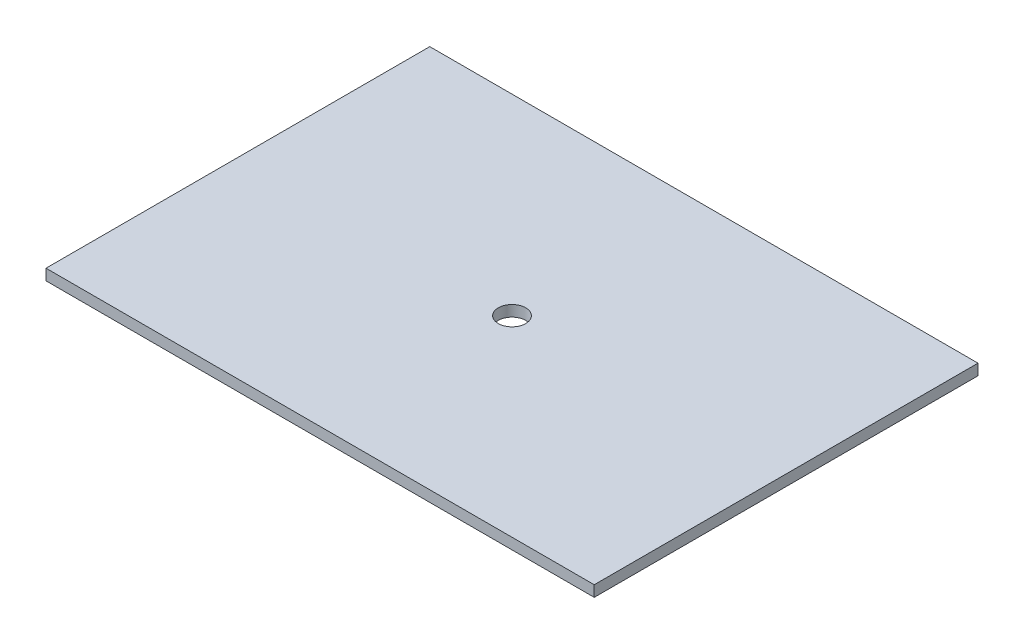
ISO-10303-21;
HEADER;
FILE_DESCRIPTION(('STEP AP214'),'2;1');
FILE_NAME('part.step','',(''),(''),'','','');
FILE_SCHEMA(('AUTOMOTIVE_DESIGN { 1 0 10303 214 1 1 1 1 }'));
ENDSEC;
DATA;
#1=APPLICATION_CONTEXT('core data for automotive mechanical design processes');
#2=APPLICATION_PROTOCOL_DEFINITION('international standard','automotive_design',2000,#1);
#3=PRODUCT_CONTEXT('',#1,'mechanical');
#4=PRODUCT('Part','Part','',(#3));
#5=PRODUCT_RELATED_PRODUCT_CATEGORY('part','',(#4));
#6=PRODUCT_DEFINITION_FORMATION('','',#4);
#7=PRODUCT_DEFINITION_CONTEXT('part definition',#1,'design');
#8=PRODUCT_DEFINITION('design','',#6,#7);
#9=PRODUCT_DEFINITION_SHAPE('','',#8);
#10=(LENGTH_UNIT() NAMED_UNIT(*) SI_UNIT(.MILLI.,.METRE.));
#11=(NAMED_UNIT(*) PLANE_ANGLE_UNIT() SI_UNIT($,.RADIAN.));
#12=(NAMED_UNIT(*) SI_UNIT($,.STERADIAN.) SOLID_ANGLE_UNIT());
#13=UNCERTAINTY_MEASURE_WITH_UNIT(LENGTH_MEASURE(1.E-05),#10,'distance_accuracy_value','');
#14=(GEOMETRIC_REPRESENTATION_CONTEXT(3) GLOBAL_UNCERTAINTY_ASSIGNED_CONTEXT((#13)) GLOBAL_UNIT_ASSIGNED_CONTEXT((#10,
#11,#12)) REPRESENTATION_CONTEXT('',''));
#15=CARTESIAN_POINT('',(0.,0.,0.));
#16=DIRECTION('',(0.,0.,1.));
#17=DIRECTION('',(1.,0.,0.));
#18=AXIS2_PLACEMENT_3D('',#15,#16,#17);
#19=CARTESIAN_POINT('',(0.,2.54,0.));
#20=DIRECTION('',(0.,1.,0.));
#21=DIRECTION('',(0.,0.,1.));
#22=AXIS2_PLACEMENT_3D('',#19,#20,#21);
#23=PLANE('',#22);
#24=DIRECTION('',(0.,0.,-1.));
#25=VECTOR('',#24,1.);
#26=CARTESIAN_POINT('',(0.,2.54,0.));
#27=LINE('',#26,#25);
#28=CARTESIAN_POINT('',(0.,2.54,0.));
#29=VERTEX_POINT('',#28);
#30=CARTESIAN_POINT('',(0.,2.54,-88.9));
#31=VERTEX_POINT('',#30);
#32=EDGE_CURVE('E86',#29,#31,#27,.T.);
#33=ORIENTED_EDGE('',*,*,#32,.T.);
#34=DIRECTION('',(-1.,0.,0.));
#35=VECTOR('',#34,1.);
#36=CARTESIAN_POINT('',(0.,2.54,-88.9));
#37=LINE('',#36,#35);
#38=CARTESIAN_POINT('',(-127.,2.54,-88.9));
#39=VERTEX_POINT('',#38);
#40=EDGE_CURVE('E81',#31,#39,#37,.T.);
#41=ORIENTED_EDGE('',*,*,#40,.T.);
#42=DIRECTION('',(0.,0.,1.));
#43=VECTOR('',#42,1.);
#44=CARTESIAN_POINT('',(-127.,2.54,0.));
#45=LINE('',#44,#43);
#46=CARTESIAN_POINT('',(-127.,2.54,0.));
#47=VERTEX_POINT('',#46);
#48=EDGE_CURVE('E84',#39,#47,#45,.T.);
#49=ORIENTED_EDGE('',*,*,#48,.T.);
#50=DIRECTION('',(1.,0.,0.));
#51=VECTOR('',#50,1.);
#52=CARTESIAN_POINT('',(0.,2.54,0.));
#53=LINE('',#52,#51);
#54=EDGE_CURVE('E51',#47,#29,#53,.T.);
#55=ORIENTED_EDGE('',*,*,#54,.T.);
#56=EDGE_LOOP('',(#33,#41,#49,#55));
#57=FACE_BOUND('',#56,.T.);
#58=CARTESIAN_POINT('',(-63.5,2.54,-44.45));
#59=DIRECTION('',(0.,1.,0.));
#60=DIRECTION('',(0.,0.,1.));
#61=AXIS2_PLACEMENT_3D('',#58,#59,#60);
#62=CIRCLE('',#61,3.175);
#63=CARTESIAN_POINT('',(-63.5,2.54,-41.275));
#64=VERTEX_POINT('',#63);
#65=EDGE_CURVE('E101',#64,#64,#62,.T.);
#66=ORIENTED_EDGE('',*,*,#65,.F.);
#67=EDGE_LOOP('',(#66));
#68=FACE_BOUND('',#67,.T.);
#69=ADVANCED_FACE('F34',(#57,#68),#23,.T.);
#70=CARTESIAN_POINT('',(0.,0.,0.));
#71=DIRECTION('',(0.,1.,0.));
#72=DIRECTION('',(0.,0.,1.));
#73=AXIS2_PLACEMENT_3D('',#70,#71,#72);
#74=PLANE('',#73);
#75=DIRECTION('',(0.,0.,-1.));
#76=VECTOR('',#75,1.);
#77=CARTESIAN_POINT('',(0.,0.,0.));
#78=LINE('',#77,#76);
#79=CARTESIAN_POINT('',(0.,0.,0.));
#80=VERTEX_POINT('',#79);
#81=CARTESIAN_POINT('',(0.,0.,-88.9));
#82=VERTEX_POINT('',#81);
#83=EDGE_CURVE('E98',#80,#82,#78,.T.);
#84=ORIENTED_EDGE('',*,*,#83,.F.);
#85=DIRECTION('',(1.,0.,0.));
#86=VECTOR('',#85,1.);
#87=CARTESIAN_POINT('',(0.,0.,0.));
#88=LINE('',#87,#86);
#89=CARTESIAN_POINT('',(-127.,0.,0.));
#90=VERTEX_POINT('',#89);
#91=EDGE_CURVE('E74',#90,#80,#88,.T.);
#92=ORIENTED_EDGE('',*,*,#91,.F.);
#93=DIRECTION('',(0.,0.,1.));
#94=VECTOR('',#93,1.);
#95=CARTESIAN_POINT('',(-127.,0.,0.));
#96=LINE('',#95,#94);
#97=CARTESIAN_POINT('',(-127.,0.,-88.9));
#98=VERTEX_POINT('',#97);
#99=EDGE_CURVE('E68',#98,#90,#96,.T.);
#100=ORIENTED_EDGE('',*,*,#99,.F.);
#101=DIRECTION('',(-1.,0.,0.));
#102=VECTOR('',#101,1.);
#103=CARTESIAN_POINT('',(0.,0.,-88.9));
#104=LINE('',#103,#102);
#105=EDGE_CURVE('E90',#82,#98,#104,.T.);
#106=ORIENTED_EDGE('',*,*,#105,.F.);
#107=EDGE_LOOP('',(#84,#92,#100,#106));
#108=FACE_BOUND('',#107,.T.);
#109=CARTESIAN_POINT('',(-63.5,0.,-44.45));
#110=DIRECTION('',(0.,1.,0.));
#111=DIRECTION('',(0.,0.,1.));
#112=AXIS2_PLACEMENT_3D('',#109,#110,#111);
#113=CIRCLE('',#112,3.175);
#114=CARTESIAN_POINT('',(-63.5,0.,-41.275));
#115=VERTEX_POINT('',#114);
#116=EDGE_CURVE('E113',#115,#115,#113,.T.);
#117=ORIENTED_EDGE('',*,*,#116,.T.);
#118=EDGE_LOOP('',(#117));
#119=FACE_BOUND('',#118,.T.);
#120=ADVANCED_FACE('F109',(#108,#119),#74,.F.);
#121=CARTESIAN_POINT('',(0.,2.54,0.));
#122=DIRECTION('',(-1.,0.,0.));
#123=DIRECTION('',(0.,0.,1.));
#124=AXIS2_PLACEMENT_3D('',#121,#122,#123);
#125=PLANE('',#124);
#126=ORIENTED_EDGE('',*,*,#83,.T.);
#127=DIRECTION('',(0.,-1.,0.));
#128=VECTOR('',#127,1.);
#129=CARTESIAN_POINT('',(0.,2.54,-88.9));
#130=LINE('',#129,#128);
#131=EDGE_CURVE('E11',#31,#82,#130,.T.);
#132=ORIENTED_EDGE('',*,*,#131,.F.);
#133=ORIENTED_EDGE('',*,*,#32,.F.);
#134=DIRECTION('',(0.,-1.,0.));
#135=VECTOR('',#134,1.);
#136=CARTESIAN_POINT('',(0.,2.54,0.));
#137=LINE('',#136,#135);
#138=EDGE_CURVE('E94',#29,#80,#137,.T.);
#139=ORIENTED_EDGE('',*,*,#138,.T.);
#140=EDGE_LOOP('',(#126,#132,#133,#139));
#141=FACE_BOUND('',#140,.T.);
#142=ADVANCED_FACE('F36',(#141),#125,.F.);
#143=CARTESIAN_POINT('',(0.,2.54,-88.9));
#144=DIRECTION('',(0.,0.,1.));
#145=DIRECTION('',(1.,0.,0.));
#146=AXIS2_PLACEMENT_3D('',#143,#144,#145);
#147=PLANE('',#146);
#148=ORIENTED_EDGE('',*,*,#105,.T.);
#149=DIRECTION('',(0.,-1.,0.));
#150=VECTOR('',#149,1.);
#151=CARTESIAN_POINT('',(-127.,2.54,-88.9));
#152=LINE('',#151,#150);
#153=EDGE_CURVE('E43',#39,#98,#152,.T.);
#154=ORIENTED_EDGE('',*,*,#153,.F.);
#155=ORIENTED_EDGE('',*,*,#40,.F.);
#156=ORIENTED_EDGE('',*,*,#131,.T.);
#157=EDGE_LOOP('',(#148,#154,#155,#156));
#158=FACE_BOUND('',#157,.T.);
#159=ADVANCED_FACE('F89',(#158),#147,.F.);
#160=CARTESIAN_POINT('',(-127.,2.54,0.));
#161=DIRECTION('',(1.,0.,0.));
#162=DIRECTION('',(0.,0.,-1.));
#163=AXIS2_PLACEMENT_3D('',#160,#161,#162);
#164=PLANE('',#163);
#165=ORIENTED_EDGE('',*,*,#99,.T.);
#166=DIRECTION('',(0.,-1.,0.));
#167=VECTOR('',#166,1.);
#168=CARTESIAN_POINT('',(-127.,2.54,0.));
#169=LINE('',#168,#167);
#170=EDGE_CURVE('E91',#47,#90,#169,.T.);
#171=ORIENTED_EDGE('',*,*,#170,.F.);
#172=ORIENTED_EDGE('',*,*,#48,.F.);
#173=ORIENTED_EDGE('',*,*,#153,.T.);
#174=EDGE_LOOP('',(#165,#171,#172,#173));
#175=FACE_BOUND('',#174,.T.);
#176=ADVANCED_FACE('F92',(#175),#164,.F.);
#177=CARTESIAN_POINT('',(0.,2.54,0.));
#178=DIRECTION('',(0.,0.,-1.));
#179=DIRECTION('',(-1.,0.,0.));
#180=AXIS2_PLACEMENT_3D('',#177,#178,#179);
#181=PLANE('',#180);
#182=ORIENTED_EDGE('',*,*,#91,.T.);
#183=ORIENTED_EDGE('',*,*,#138,.F.);
#184=ORIENTED_EDGE('',*,*,#54,.F.);
#185=ORIENTED_EDGE('',*,*,#170,.T.);
#186=EDGE_LOOP('',(#182,#183,#184,#185));
#187=FACE_BOUND('',#186,.T.);
#188=ADVANCED_FACE('F106',(#187),#181,.F.);
#189=CARTESIAN_POINT('',(-63.5,2.54,-44.45));
#190=DIRECTION('',(0.,-1.,0.));
#191=DIRECTION('',(0.,0.,-1.));
#192=AXIS2_PLACEMENT_3D('',#189,#190,#191);
#193=CYLINDRICAL_SURFACE('',#192,3.175);
#194=ORIENTED_EDGE('',*,*,#65,.T.);
#195=EDGE_LOOP('',(#194));
#196=FACE_BOUND('',#195,.T.);
#197=ORIENTED_EDGE('',*,*,#116,.F.);
#198=EDGE_LOOP('',(#197));
#199=FACE_BOUND('',#198,.T.);
#200=ADVANCED_FACE('F119',(#196,#199),#193,.F.);
#201=CLOSED_SHELL('',(#69,#120,#142,#159,#176,#188,#200));
#202=MANIFOLD_SOLID_BREP('B2',#201);
#203=ADVANCED_BREP_SHAPE_REPRESENTATION('',(#18,#202),#14);
#204=SHAPE_DEFINITION_REPRESENTATION(#9,#203);
ENDSEC;
END-ISO-10303-21;
